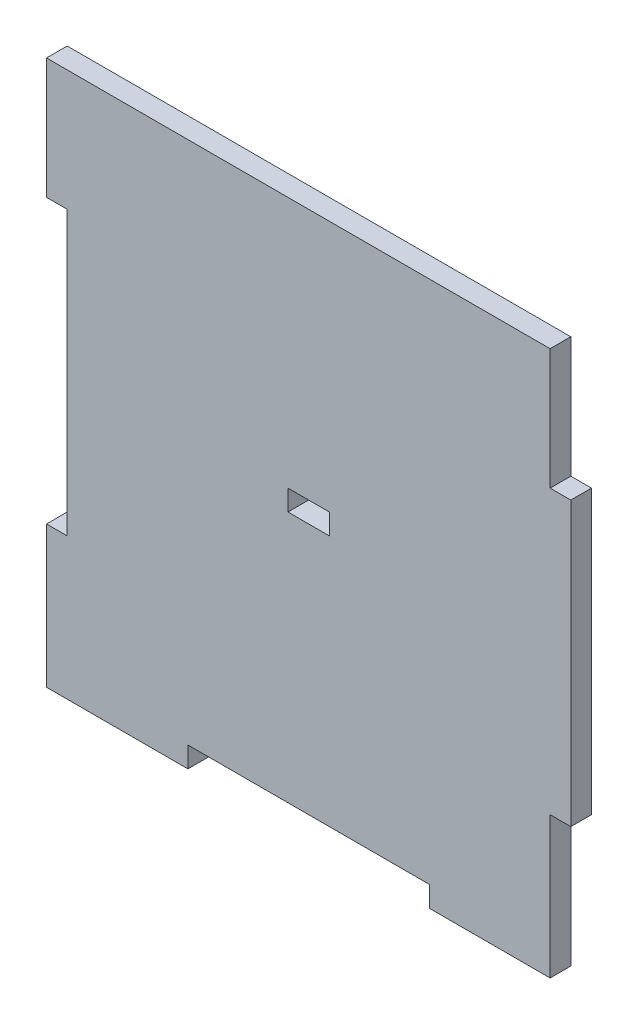
ISO-10303-21;
HEADER;
FILE_DESCRIPTION(('STEP AP214'),'2;1');
FILE_NAME('part.step','',(''),(''),'','','');
FILE_SCHEMA(('AUTOMOTIVE_DESIGN { 1 0 10303 214 1 1 1 1 }'));
ENDSEC;
DATA;
#1=APPLICATION_CONTEXT('core data for automotive mechanical design processes');
#2=APPLICATION_PROTOCOL_DEFINITION('international standard','automotive_design',2000,#1);
#3=PRODUCT_CONTEXT('',#1,'mechanical');
#4=PRODUCT('Part','Part','',(#3));
#5=PRODUCT_RELATED_PRODUCT_CATEGORY('part','',(#4));
#6=PRODUCT_DEFINITION_FORMATION('','',#4);
#7=PRODUCT_DEFINITION_CONTEXT('part definition',#1,'design');
#8=PRODUCT_DEFINITION('design','',#6,#7);
#9=PRODUCT_DEFINITION_SHAPE('','',#8);
#10=(LENGTH_UNIT() NAMED_UNIT(*) SI_UNIT(.MILLI.,.METRE.));
#11=(NAMED_UNIT(*) PLANE_ANGLE_UNIT() SI_UNIT($,.RADIAN.));
#12=(NAMED_UNIT(*) SI_UNIT($,.STERADIAN.) SOLID_ANGLE_UNIT());
#13=UNCERTAINTY_MEASURE_WITH_UNIT(LENGTH_MEASURE(1.E-05),#10,'distance_accuracy_value','');
#14=(GEOMETRIC_REPRESENTATION_CONTEXT(3) GLOBAL_UNCERTAINTY_ASSIGNED_CONTEXT((#13)) GLOBAL_UNIT_ASSIGNED_CONTEXT((#10,
#11,#12)) REPRESENTATION_CONTEXT('',''));
#15=CARTESIAN_POINT('',(0.,0.,0.));
#16=DIRECTION('',(0.,0.,1.));
#17=DIRECTION('',(1.,0.,0.));
#18=AXIS2_PLACEMENT_3D('',#15,#16,#17);
#19=CARTESIAN_POINT('',(35.,-20.5,3.));
#20=DIRECTION('',(0.,1.,0.));
#21=DIRECTION('',(-1.,0.,0.));
#22=AXIS2_PLACEMENT_3D('',#19,#20,#21);
#23=PLANE('',#22);
#24=DIRECTION('',(1.,0.,0.));
#25=VECTOR('',#24,1.);
#26=CARTESIAN_POINT('',(35.,-20.5,0.));
#27=LINE('',#26,#25);
#28=CARTESIAN_POINT('',(35.,-20.5,0.));
#29=VERTEX_POINT('',#28);
#30=CARTESIAN_POINT('',(38.,-20.5,0.));
#31=VERTEX_POINT('',#30);
#32=EDGE_CURVE('E218',#29,#31,#27,.T.);
#33=ORIENTED_EDGE('',*,*,#32,.T.);
#34=DIRECTION('',(0.,0.,-1.));
#35=VECTOR('',#34,1.);
#36=CARTESIAN_POINT('',(38.,-20.5,3.));
#37=LINE('',#36,#35);
#38=CARTESIAN_POINT('',(38.,-20.5,3.));
#39=VERTEX_POINT('',#38);
#40=EDGE_CURVE('E46',#39,#31,#37,.T.);
#41=ORIENTED_EDGE('',*,*,#40,.F.);
#42=DIRECTION('',(1.,0.,0.));
#43=VECTOR('',#42,1.);
#44=CARTESIAN_POINT('',(35.,-20.5,3.));
#45=LINE('',#44,#43);
#46=CARTESIAN_POINT('',(35.,-20.5,3.));
#47=VERTEX_POINT('',#46);
#48=EDGE_CURVE('E228',#47,#39,#45,.T.);
#49=ORIENTED_EDGE('',*,*,#48,.F.);
#50=DIRECTION('',(0.,0.,-1.));
#51=VECTOR('',#50,1.);
#52=CARTESIAN_POINT('',(35.,-20.5,3.));
#53=LINE('',#52,#51);
#54=EDGE_CURVE('E11',#47,#29,#53,.T.);
#55=ORIENTED_EDGE('',*,*,#54,.T.);
#56=EDGE_LOOP('',(#33,#41,#49,#55));
#57=FACE_BOUND('',#56,.T.);
#58=ADVANCED_FACE('F38',(#57),#23,.F.);
#59=CARTESIAN_POINT('',(38.,20.5,3.));
#60=DIRECTION('',(-1.,0.,0.));
#61=DIRECTION('',(0.,0.,1.));
#62=AXIS2_PLACEMENT_3D('',#59,#60,#61);
#63=PLANE('',#62);
#64=DIRECTION('',(0.,1.,0.));
#65=VECTOR('',#64,1.);
#66=CARTESIAN_POINT('',(38.,20.5,0.));
#67=LINE('',#66,#65);
#68=CARTESIAN_POINT('',(38.,20.5,0.));
#69=VERTEX_POINT('',#68);
#70=EDGE_CURVE('E278',#31,#69,#67,.T.);
#71=ORIENTED_EDGE('',*,*,#70,.T.);
#72=DIRECTION('',(0.,0.,-1.));
#73=VECTOR('',#72,1.);
#74=CARTESIAN_POINT('',(38.,20.5,3.));
#75=LINE('',#74,#73);
#76=CARTESIAN_POINT('',(38.,20.5,3.));
#77=VERTEX_POINT('',#76);
#78=EDGE_CURVE('E376',#77,#69,#75,.T.);
#79=ORIENTED_EDGE('',*,*,#78,.F.);
#80=DIRECTION('',(0.,1.,0.));
#81=VECTOR('',#80,1.);
#82=CARTESIAN_POINT('',(38.,20.5,3.));
#83=LINE('',#82,#81);
#84=EDGE_CURVE('E232',#39,#77,#83,.T.);
#85=ORIENTED_EDGE('',*,*,#84,.F.);
#86=ORIENTED_EDGE('',*,*,#40,.T.);
#87=EDGE_LOOP('',(#71,#79,#85,#86));
#88=FACE_BOUND('',#87,.T.);
#89=ADVANCED_FACE('F385',(#88),#63,.F.);
#90=CARTESIAN_POINT('',(35.,20.5,3.));
#91=DIRECTION('',(0.,-1.,0.));
#92=DIRECTION('',(1.,0.,0.));
#93=AXIS2_PLACEMENT_3D('',#90,#91,#92);
#94=PLANE('',#93);
#95=DIRECTION('',(-1.,0.,0.));
#96=VECTOR('',#95,1.);
#97=CARTESIAN_POINT('',(35.,20.5,0.));
#98=LINE('',#97,#96);
#99=CARTESIAN_POINT('',(35.,20.5,0.));
#100=VERTEX_POINT('',#99);
#101=EDGE_CURVE('E281',#69,#100,#98,.T.);
#102=ORIENTED_EDGE('',*,*,#101,.T.);
#103=DIRECTION('',(0.,0.,-1.));
#104=VECTOR('',#103,1.);
#105=CARTESIAN_POINT('',(35.,20.5,3.));
#106=LINE('',#105,#104);
#107=CARTESIAN_POINT('',(35.,20.5,3.));
#108=VERTEX_POINT('',#107);
#109=EDGE_CURVE('E372',#108,#100,#106,.T.);
#110=ORIENTED_EDGE('',*,*,#109,.F.);
#111=DIRECTION('',(-1.,0.,0.));
#112=VECTOR('',#111,1.);
#113=CARTESIAN_POINT('',(35.,20.5,3.));
#114=LINE('',#113,#112);
#115=EDGE_CURVE('E235',#77,#108,#114,.T.);
#116=ORIENTED_EDGE('',*,*,#115,.F.);
#117=ORIENTED_EDGE('',*,*,#78,.T.);
#118=EDGE_LOOP('',(#102,#110,#116,#117));
#119=FACE_BOUND('',#118,.T.);
#120=ADVANCED_FACE('F394',(#119),#94,.F.);
#121=CARTESIAN_POINT('',(35.,38.,3.));
#122=DIRECTION('',(-1.,0.,0.));
#123=DIRECTION('',(0.,-1.,0.));
#124=AXIS2_PLACEMENT_3D('',#121,#122,#123);
#125=PLANE('',#124);
#126=DIRECTION('',(0.,1.,0.));
#127=VECTOR('',#126,1.);
#128=CARTESIAN_POINT('',(35.,38.,0.));
#129=LINE('',#128,#127);
#130=CARTESIAN_POINT('',(35.,38.,0.));
#131=VERTEX_POINT('',#130);
#132=EDGE_CURVE('E284',#100,#131,#129,.T.);
#133=ORIENTED_EDGE('',*,*,#132,.T.);
#134=DIRECTION('',(0.,0.,-1.));
#135=VECTOR('',#134,1.);
#136=CARTESIAN_POINT('',(35.,38.,3.));
#137=LINE('',#136,#135);
#138=CARTESIAN_POINT('',(35.,38.,3.));
#139=VERTEX_POINT('',#138);
#140=EDGE_CURVE('E368',#139,#131,#137,.T.);
#141=ORIENTED_EDGE('',*,*,#140,.F.);
#142=DIRECTION('',(0.,1.,0.));
#143=VECTOR('',#142,1.);
#144=CARTESIAN_POINT('',(35.,38.,3.));
#145=LINE('',#144,#143);
#146=EDGE_CURVE('E238',#108,#139,#145,.T.);
#147=ORIENTED_EDGE('',*,*,#146,.F.);
#148=ORIENTED_EDGE('',*,*,#109,.T.);
#149=EDGE_LOOP('',(#133,#141,#147,#148));
#150=FACE_BOUND('',#149,.T.);
#151=ADVANCED_FACE('F398',(#150),#125,.F.);
#152=CARTESIAN_POINT('',(-38.,38.,3.));
#153=DIRECTION('',(0.,-1.,0.));
#154=DIRECTION('',(0.,0.,-1.));
#155=AXIS2_PLACEMENT_3D('',#152,#153,#154);
#156=PLANE('',#155);
#157=DIRECTION('',(-1.,0.,0.));
#158=VECTOR('',#157,1.);
#159=CARTESIAN_POINT('',(-38.,38.,0.));
#160=LINE('',#159,#158);
#161=CARTESIAN_POINT('',(-38.,38.,0.));
#162=VERTEX_POINT('',#161);
#163=EDGE_CURVE('E288',#131,#162,#160,.T.);
#164=ORIENTED_EDGE('',*,*,#163,.T.);
#165=DIRECTION('',(0.,0.,-1.));
#166=VECTOR('',#165,1.);
#167=CARTESIAN_POINT('',(-38.,38.,3.));
#168=LINE('',#167,#166);
#169=CARTESIAN_POINT('',(-38.,38.,3.));
#170=VERTEX_POINT('',#169);
#171=EDGE_CURVE('E364',#170,#162,#168,.T.);
#172=ORIENTED_EDGE('',*,*,#171,.F.);
#173=DIRECTION('',(-1.,0.,0.));
#174=VECTOR('',#173,1.);
#175=CARTESIAN_POINT('',(17.5,38.,3.));
#176=LINE('',#175,#174);
#177=EDGE_CURVE('E241',#139,#170,#176,.T.);
#178=ORIENTED_EDGE('',*,*,#177,.F.);
#179=ORIENTED_EDGE('',*,*,#140,.T.);
#180=EDGE_LOOP('',(#164,#172,#178,#179));
#181=FACE_BOUND('',#180,.T.);
#182=ADVANCED_FACE('F456',(#181),#156,.F.);
#183=CARTESIAN_POINT('',(-38.,20.5,3.));
#184=DIRECTION('',(1.,0.,0.));
#185=DIRECTION('',(0.,0.,-1.));
#186=AXIS2_PLACEMENT_3D('',#183,#184,#185);
#187=PLANE('',#186);
#188=DIRECTION('',(0.,-1.,0.));
#189=VECTOR('',#188,1.);
#190=CARTESIAN_POINT('',(-38.,20.5,0.));
#191=LINE('',#190,#189);
#192=CARTESIAN_POINT('',(-38.,20.5,0.));
#193=VERTEX_POINT('',#192);
#194=EDGE_CURVE('E291',#162,#193,#191,.T.);
#195=ORIENTED_EDGE('',*,*,#194,.T.);
#196=DIRECTION('',(0.,0.,-1.));
#197=VECTOR('',#196,1.);
#198=CARTESIAN_POINT('',(-38.,20.5,3.));
#199=LINE('',#198,#197);
#200=CARTESIAN_POINT('',(-38.,20.5,3.));
#201=VERTEX_POINT('',#200);
#202=EDGE_CURVE('E360',#201,#193,#199,.T.);
#203=ORIENTED_EDGE('',*,*,#202,.F.);
#204=DIRECTION('',(0.,-1.,0.));
#205=VECTOR('',#204,1.);
#206=CARTESIAN_POINT('',(-38.,20.5,3.));
#207=LINE('',#206,#205);
#208=EDGE_CURVE('E244',#170,#201,#207,.T.);
#209=ORIENTED_EDGE('',*,*,#208,.F.);
#210=ORIENTED_EDGE('',*,*,#171,.T.);
#211=EDGE_LOOP('',(#195,#203,#209,#210));
#212=FACE_BOUND('',#211,.T.);
#213=ADVANCED_FACE('F454',(#212),#187,.F.);
#214=CARTESIAN_POINT('',(-35.,20.5,3.));
#215=DIRECTION('',(0.,1.,0.));
#216=DIRECTION('',(0.,0.,1.));
#217=AXIS2_PLACEMENT_3D('',#214,#215,#216);
#218=PLANE('',#217);
#219=DIRECTION('',(1.,0.,0.));
#220=VECTOR('',#219,1.);
#221=CARTESIAN_POINT('',(-35.,20.5,0.));
#222=LINE('',#221,#220);
#223=CARTESIAN_POINT('',(-35.,20.5,0.));
#224=VERTEX_POINT('',#223);
#225=EDGE_CURVE('E294',#193,#224,#222,.T.);
#226=ORIENTED_EDGE('',*,*,#225,.T.);
#227=DIRECTION('',(0.,0.,-1.));
#228=VECTOR('',#227,1.);
#229=CARTESIAN_POINT('',(-35.,20.5,3.));
#230=LINE('',#229,#228);
#231=CARTESIAN_POINT('',(-35.,20.5,3.));
#232=VERTEX_POINT('',#231);
#233=EDGE_CURVE('E356',#232,#224,#230,.T.);
#234=ORIENTED_EDGE('',*,*,#233,.F.);
#235=DIRECTION('',(1.,0.,0.));
#236=VECTOR('',#235,1.);
#237=CARTESIAN_POINT('',(-35.,20.5,3.));
#238=LINE('',#237,#236);
#239=EDGE_CURVE('E247',#201,#232,#238,.T.);
#240=ORIENTED_EDGE('',*,*,#239,.F.);
#241=ORIENTED_EDGE('',*,*,#202,.T.);
#242=EDGE_LOOP('',(#226,#234,#240,#241));
#243=FACE_BOUND('',#242,.T.);
#244=ADVANCED_FACE('F449',(#243),#218,.F.);
#245=CARTESIAN_POINT('',(-35.,20.5,3.));
#246=DIRECTION('',(1.,0.,0.));
#247=DIRECTION('',(0.,0.,-1.));
#248=AXIS2_PLACEMENT_3D('',#245,#246,#247);
#249=PLANE('',#248);
#250=DIRECTION('',(0.,-1.,0.));
#251=VECTOR('',#250,1.);
#252=CARTESIAN_POINT('',(-35.,20.5,0.));
#253=LINE('',#252,#251);
#254=CARTESIAN_POINT('',(-35.,-20.5,0.));
#255=VERTEX_POINT('',#254);
#256=EDGE_CURVE('E297',#224,#255,#253,.T.);
#257=ORIENTED_EDGE('',*,*,#256,.T.);
#258=DIRECTION('',(0.,0.,-1.));
#259=VECTOR('',#258,1.);
#260=CARTESIAN_POINT('',(-35.,-20.5,3.));
#261=LINE('',#260,#259);
#262=CARTESIAN_POINT('',(-35.,-20.5,3.));
#263=VERTEX_POINT('',#262);
#264=EDGE_CURVE('E352',#263,#255,#261,.T.);
#265=ORIENTED_EDGE('',*,*,#264,.F.);
#266=DIRECTION('',(0.,-1.,0.));
#267=VECTOR('',#266,1.);
#268=CARTESIAN_POINT('',(-35.,20.5,3.));
#269=LINE('',#268,#267);
#270=EDGE_CURVE('E250',#232,#263,#269,.T.);
#271=ORIENTED_EDGE('',*,*,#270,.F.);
#272=ORIENTED_EDGE('',*,*,#233,.T.);
#273=EDGE_LOOP('',(#257,#265,#271,#272));
#274=FACE_BOUND('',#273,.T.);
#275=ADVANCED_FACE('F444',(#274),#249,.F.);
#276=CARTESIAN_POINT('',(-35.,-20.5,3.));
#277=DIRECTION('',(0.,-1.,0.));
#278=DIRECTION('',(0.,0.,-1.));
#279=AXIS2_PLACEMENT_3D('',#276,#277,#278);
#280=PLANE('',#279);
#281=DIRECTION('',(-1.,0.,0.));
#282=VECTOR('',#281,1.);
#283=CARTESIAN_POINT('',(-35.,-20.5,0.));
#284=LINE('',#283,#282);
#285=CARTESIAN_POINT('',(-38.,-20.5,0.));
#286=VERTEX_POINT('',#285);
#287=EDGE_CURVE('E300',#255,#286,#284,.T.);
#288=ORIENTED_EDGE('',*,*,#287,.T.);
#289=DIRECTION('',(0.,0.,-1.));
#290=VECTOR('',#289,1.);
#291=CARTESIAN_POINT('',(-38.,-20.5,3.));
#292=LINE('',#291,#290);
#293=CARTESIAN_POINT('',(-38.,-20.5,3.));
#294=VERTEX_POINT('',#293);
#295=EDGE_CURVE('E348',#294,#286,#292,.T.);
#296=ORIENTED_EDGE('',*,*,#295,.F.);
#297=DIRECTION('',(-1.,0.,0.));
#298=VECTOR('',#297,1.);
#299=CARTESIAN_POINT('',(-35.,-20.5,3.));
#300=LINE('',#299,#298);
#301=EDGE_CURVE('E253',#263,#294,#300,.T.);
#302=ORIENTED_EDGE('',*,*,#301,.F.);
#303=ORIENTED_EDGE('',*,*,#264,.T.);
#304=EDGE_LOOP('',(#288,#296,#302,#303));
#305=FACE_BOUND('',#304,.T.);
#306=ADVANCED_FACE('F439',(#305),#280,.F.);
#307=CARTESIAN_POINT('',(-38.,-38.,3.));
#308=DIRECTION('',(1.,0.,0.));
#309=DIRECTION('',(0.,0.,-1.));
#310=AXIS2_PLACEMENT_3D('',#307,#308,#309);
#311=PLANE('',#310);
#312=DIRECTION('',(0.,-1.,0.));
#313=VECTOR('',#312,1.);
#314=CARTESIAN_POINT('',(-38.,-38.,0.));
#315=LINE('',#314,#313);
#316=CARTESIAN_POINT('',(-38.,-41.,0.));
#317=VERTEX_POINT('',#316);
#318=EDGE_CURVE('E304',#286,#317,#315,.T.);
#319=ORIENTED_EDGE('',*,*,#318,.T.);
#320=DIRECTION('',(0.,0.,-1.));
#321=VECTOR('',#320,1.);
#322=CARTESIAN_POINT('',(-38.,-41.,3.));
#323=LINE('',#322,#321);
#324=CARTESIAN_POINT('',(-38.,-41.,3.));
#325=VERTEX_POINT('',#324);
#326=EDGE_CURVE('E344',#325,#317,#323,.T.);
#327=ORIENTED_EDGE('',*,*,#326,.F.);
#328=DIRECTION('',(0.,-1.,0.));
#329=VECTOR('',#328,1.);
#330=CARTESIAN_POINT('',(-38.,-20.5,3.));
#331=LINE('',#330,#329);
#332=EDGE_CURVE('E256',#294,#325,#331,.T.);
#333=ORIENTED_EDGE('',*,*,#332,.F.);
#334=ORIENTED_EDGE('',*,*,#295,.T.);
#335=EDGE_LOOP('',(#319,#327,#333,#334));
#336=FACE_BOUND('',#335,.T.);
#337=ADVANCED_FACE('F434',(#336),#311,.F.);
#338=CARTESIAN_POINT('',(-35.,-41.,3.));
#339=DIRECTION('',(0.,1.,0.));
#340=DIRECTION('',(0.,0.,1.));
#341=AXIS2_PLACEMENT_3D('',#338,#339,#340);
#342=PLANE('',#341);
#343=DIRECTION('',(1.,0.,0.));
#344=VECTOR('',#343,1.);
#345=CARTESIAN_POINT('',(-35.,-41.,0.));
#346=LINE('',#345,#344);
#347=CARTESIAN_POINT('',(-17.5,-41.,0.));
#348=VERTEX_POINT('',#347);
#349=EDGE_CURVE('E308',#317,#348,#346,.T.);
#350=ORIENTED_EDGE('',*,*,#349,.T.);
#351=DIRECTION('',(0.,0.,-1.));
#352=VECTOR('',#351,1.);
#353=CARTESIAN_POINT('',(-17.5,-41.,3.));
#354=LINE('',#353,#352);
#355=CARTESIAN_POINT('',(-17.5,-41.,3.));
#356=VERTEX_POINT('',#355);
#357=EDGE_CURVE('E340',#356,#348,#354,.T.);
#358=ORIENTED_EDGE('',*,*,#357,.F.);
#359=DIRECTION('',(1.,0.,0.));
#360=VECTOR('',#359,1.);
#361=CARTESIAN_POINT('',(-38.,-41.,3.));
#362=LINE('',#361,#360);
#363=EDGE_CURVE('E259',#325,#356,#362,.T.);
#364=ORIENTED_EDGE('',*,*,#363,.F.);
#365=ORIENTED_EDGE('',*,*,#326,.T.);
#366=EDGE_LOOP('',(#350,#358,#364,#365));
#367=FACE_BOUND('',#366,.T.);
#368=ADVANCED_FACE('F430',(#367),#342,.F.);
#369=CARTESIAN_POINT('',(-17.5,-38.,3.));
#370=DIRECTION('',(-1.,0.,0.));
#371=DIRECTION('',(0.,0.,1.));
#372=AXIS2_PLACEMENT_3D('',#369,#370,#371);
#373=PLANE('',#372);
#374=DIRECTION('',(0.,1.,0.));
#375=VECTOR('',#374,1.);
#376=CARTESIAN_POINT('',(-17.5,-38.,0.));
#377=LINE('',#376,#375);
#378=CARTESIAN_POINT('',(-17.5,-38.,0.));
#379=VERTEX_POINT('',#378);
#380=EDGE_CURVE('E311',#348,#379,#377,.T.);
#381=ORIENTED_EDGE('',*,*,#380,.T.);
#382=DIRECTION('',(0.,0.,-1.));
#383=VECTOR('',#382,1.);
#384=CARTESIAN_POINT('',(-17.5,-38.,3.));
#385=LINE('',#384,#383);
#386=CARTESIAN_POINT('',(-17.5,-38.,3.));
#387=VERTEX_POINT('',#386);
#388=EDGE_CURVE('E336',#387,#379,#385,.T.);
#389=ORIENTED_EDGE('',*,*,#388,.F.);
#390=DIRECTION('',(0.,1.,0.));
#391=VECTOR('',#390,1.);
#392=CARTESIAN_POINT('',(-17.5,-38.,3.));
#393=LINE('',#392,#391);
#394=EDGE_CURVE('E262',#356,#387,#393,.T.);
#395=ORIENTED_EDGE('',*,*,#394,.F.);
#396=ORIENTED_EDGE('',*,*,#357,.T.);
#397=EDGE_LOOP('',(#381,#389,#395,#396));
#398=FACE_BOUND('',#397,.T.);
#399=ADVANCED_FACE('F425',(#398),#373,.F.);
#400=CARTESIAN_POINT('',(-17.5,-38.,3.));
#401=DIRECTION('',(0.,1.,0.));
#402=DIRECTION('',(-1.,0.,0.));
#403=AXIS2_PLACEMENT_3D('',#400,#401,#402);
#404=PLANE('',#403);
#405=DIRECTION('',(1.,0.,0.));
#406=VECTOR('',#405,1.);
#407=CARTESIAN_POINT('',(-17.5,-38.,0.));
#408=LINE('',#407,#406);
#409=CARTESIAN_POINT('',(17.5,-38.,0.));
#410=VERTEX_POINT('',#409);
#411=EDGE_CURVE('E314',#379,#410,#408,.T.);
#412=ORIENTED_EDGE('',*,*,#411,.T.);
#413=DIRECTION('',(0.,0.,-1.));
#414=VECTOR('',#413,1.);
#415=CARTESIAN_POINT('',(17.5,-38.,3.));
#416=LINE('',#415,#414);
#417=CARTESIAN_POINT('',(17.5,-38.,3.));
#418=VERTEX_POINT('',#417);
#419=EDGE_CURVE('E332',#418,#410,#416,.T.);
#420=ORIENTED_EDGE('',*,*,#419,.F.);
#421=DIRECTION('',(1.,0.,0.));
#422=VECTOR('',#421,1.);
#423=CARTESIAN_POINT('',(-17.5,-38.,3.));
#424=LINE('',#423,#422);
#425=EDGE_CURVE('E265',#387,#418,#424,.T.);
#426=ORIENTED_EDGE('',*,*,#425,.F.);
#427=ORIENTED_EDGE('',*,*,#388,.T.);
#428=EDGE_LOOP('',(#412,#420,#426,#427));
#429=FACE_BOUND('',#428,.T.);
#430=ADVANCED_FACE('F421',(#429),#404,.F.);
#431=CARTESIAN_POINT('',(17.5,-41.,3.));
#432=DIRECTION('',(1.,0.,0.));
#433=DIRECTION('',(0.,1.,0.));
#434=AXIS2_PLACEMENT_3D('',#431,#432,#433);
#435=PLANE('',#434);
#436=DIRECTION('',(0.,-1.,0.));
#437=VECTOR('',#436,1.);
#438=CARTESIAN_POINT('',(17.5,-41.,0.));
#439=LINE('',#438,#437);
#440=CARTESIAN_POINT('',(17.5,-41.,0.));
#441=VERTEX_POINT('',#440);
#442=EDGE_CURVE('E317',#410,#441,#439,.T.);
#443=ORIENTED_EDGE('',*,*,#442,.T.);
#444=DIRECTION('',(0.,0.,-1.));
#445=VECTOR('',#444,1.);
#446=CARTESIAN_POINT('',(17.5,-41.,3.));
#447=LINE('',#446,#445);
#448=CARTESIAN_POINT('',(17.5,-41.,3.));
#449=VERTEX_POINT('',#448);
#450=EDGE_CURVE('E328',#449,#441,#447,.T.);
#451=ORIENTED_EDGE('',*,*,#450,.F.);
#452=DIRECTION('',(0.,-1.,0.));
#453=VECTOR('',#452,1.);
#454=CARTESIAN_POINT('',(17.5,-41.,3.));
#455=LINE('',#454,#453);
#456=EDGE_CURVE('E268',#418,#449,#455,.T.);
#457=ORIENTED_EDGE('',*,*,#456,.F.);
#458=ORIENTED_EDGE('',*,*,#419,.T.);
#459=EDGE_LOOP('',(#443,#451,#457,#458));
#460=FACE_BOUND('',#459,.T.);
#461=ADVANCED_FACE('F417',(#460),#435,.F.);
#462=CARTESIAN_POINT('',(35.,-41.,3.));
#463=DIRECTION('',(0.,1.,0.));
#464=DIRECTION('',(-1.,0.,0.));
#465=AXIS2_PLACEMENT_3D('',#462,#463,#464);
#466=PLANE('',#465);
#467=DIRECTION('',(1.,0.,0.));
#468=VECTOR('',#467,1.);
#469=CARTESIAN_POINT('',(35.,-41.,0.));
#470=LINE('',#469,#468);
#471=CARTESIAN_POINT('',(35.,-41.,0.));
#472=VERTEX_POINT('',#471);
#473=EDGE_CURVE('E320',#441,#472,#470,.T.);
#474=ORIENTED_EDGE('',*,*,#473,.T.);
#475=DIRECTION('',(0.,0.,-1.));
#476=VECTOR('',#475,1.);
#477=CARTESIAN_POINT('',(35.,-41.,3.));
#478=LINE('',#477,#476);
#479=CARTESIAN_POINT('',(35.,-41.,3.));
#480=VERTEX_POINT('',#479);
#481=EDGE_CURVE('E275',#480,#472,#478,.T.);
#482=ORIENTED_EDGE('',*,*,#481,.F.);
#483=DIRECTION('',(1.,0.,0.));
#484=VECTOR('',#483,1.);
#485=CARTESIAN_POINT('',(35.,-41.,3.));
#486=LINE('',#485,#484);
#487=EDGE_CURVE('E271',#449,#480,#486,.T.);
#488=ORIENTED_EDGE('',*,*,#487,.F.);
#489=ORIENTED_EDGE('',*,*,#450,.T.);
#490=EDGE_LOOP('',(#474,#482,#488,#489));
#491=FACE_BOUND('',#490,.T.);
#492=ADVANCED_FACE('F412',(#491),#466,.F.);
#493=CARTESIAN_POINT('',(35.,-38.,3.));
#494=DIRECTION('',(-1.,0.,0.));
#495=DIRECTION('',(0.,-1.,0.));
#496=AXIS2_PLACEMENT_3D('',#493,#494,#495);
#497=PLANE('',#496);
#498=DIRECTION('',(0.,1.,0.));
#499=VECTOR('',#498,1.);
#500=CARTESIAN_POINT('',(35.,-38.,0.));
#501=LINE('',#500,#499);
#502=EDGE_CURVE('E229',#472,#29,#501,.T.);
#503=ORIENTED_EDGE('',*,*,#502,.T.);
#504=ORIENTED_EDGE('',*,*,#54,.F.);
#505=DIRECTION('',(0.,1.,0.));
#506=VECTOR('',#505,1.);
#507=CARTESIAN_POINT('',(35.,-20.5,3.));
#508=LINE('',#507,#506);
#509=EDGE_CURVE('E224',#480,#47,#508,.T.);
#510=ORIENTED_EDGE('',*,*,#509,.F.);
#511=ORIENTED_EDGE('',*,*,#481,.T.);
#512=EDGE_LOOP('',(#503,#504,#510,#511));
#513=FACE_BOUND('',#512,.T.);
#514=ADVANCED_FACE('F406',(#513),#497,.F.);
#515=CARTESIAN_POINT('',(0.,0.,3.));
#516=DIRECTION('',(0.,0.,-1.));
#517=DIRECTION('',(-1.,0.,0.));
#518=AXIS2_PLACEMENT_3D('',#515,#516,#517);
#519=PLANE('',#518);
#520=DIRECTION('',(-1.,0.,0.));
#521=VECTOR('',#520,1.);
#522=CARTESIAN_POINT('',(-3.,1.5,3.));
#523=LINE('',#522,#521);
#524=CARTESIAN_POINT('',(3.,1.5,3.));
#525=VERTEX_POINT('',#524);
#526=CARTESIAN_POINT('',(-3.,1.5,3.));
#527=VERTEX_POINT('',#526);
#528=EDGE_CURVE('E209',#525,#527,#523,.T.);
#529=ORIENTED_EDGE('',*,*,#528,.F.);
#530=DIRECTION('',(0.,1.,0.));
#531=VECTOR('',#530,1.);
#532=CARTESIAN_POINT('',(3.,-1.5,3.));
#533=LINE('',#532,#531);
#534=CARTESIAN_POINT('',(3.,-1.5,3.));
#535=VERTEX_POINT('',#534);
#536=EDGE_CURVE('E53',#535,#525,#533,.T.);
#537=ORIENTED_EDGE('',*,*,#536,.F.);
#538=DIRECTION('',(1.,0.,0.));
#539=VECTOR('',#538,1.);
#540=CARTESIAN_POINT('',(-3.,-1.5,3.));
#541=LINE('',#540,#539);
#542=CARTESIAN_POINT('',(-3.,-1.5,3.));
#543=VERTEX_POINT('',#542);
#544=EDGE_CURVE('E196',#543,#535,#541,.T.);
#545=ORIENTED_EDGE('',*,*,#544,.F.);
#546=DIRECTION('',(0.,-1.,0.));
#547=VECTOR('',#546,1.);
#548=CARTESIAN_POINT('',(-3.,-1.5,3.));
#549=LINE('',#548,#547);
#550=EDGE_CURVE('E200',#527,#543,#549,.T.);
#551=ORIENTED_EDGE('',*,*,#550,.F.);
#552=EDGE_LOOP('',(#529,#537,#545,#551));
#553=FACE_BOUND('',#552,.T.);
#554=ORIENTED_EDGE('',*,*,#509,.T.);
#555=ORIENTED_EDGE('',*,*,#48,.T.);
#556=ORIENTED_EDGE('',*,*,#84,.T.);
#557=ORIENTED_EDGE('',*,*,#115,.T.);
#558=ORIENTED_EDGE('',*,*,#146,.T.);
#559=ORIENTED_EDGE('',*,*,#177,.T.);
#560=ORIENTED_EDGE('',*,*,#208,.T.);
#561=ORIENTED_EDGE('',*,*,#239,.T.);
#562=ORIENTED_EDGE('',*,*,#270,.T.);
#563=ORIENTED_EDGE('',*,*,#301,.T.);
#564=ORIENTED_EDGE('',*,*,#332,.T.);
#565=ORIENTED_EDGE('',*,*,#363,.T.);
#566=ORIENTED_EDGE('',*,*,#394,.T.);
#567=ORIENTED_EDGE('',*,*,#425,.T.);
#568=ORIENTED_EDGE('',*,*,#456,.T.);
#569=ORIENTED_EDGE('',*,*,#487,.T.);
#570=EDGE_LOOP('',(#554,#555,#556,#557,#558,#559,#560,#561,#562,#563,#564,#565,#566,#567,#568,#569));
#571=FACE_BOUND('',#570,.T.);
#572=ADVANCED_FACE('F402',(#553,#571),#519,.F.);
#573=CARTESIAN_POINT('',(0.,0.,0.));
#574=DIRECTION('',(0.,0.,-1.));
#575=DIRECTION('',(-1.,0.,0.));
#576=AXIS2_PLACEMENT_3D('',#573,#574,#575);
#577=PLANE('',#576);
#578=DIRECTION('',(0.,1.,0.));
#579=VECTOR('',#578,1.);
#580=CARTESIAN_POINT('',(3.,-1.5,0.));
#581=LINE('',#580,#579);
#582=CARTESIAN_POINT('',(3.,-1.5,0.));
#583=VERTEX_POINT('',#582);
#584=CARTESIAN_POINT('',(3.,1.5,0.));
#585=VERTEX_POINT('',#584);
#586=EDGE_CURVE('E177',#583,#585,#581,.T.);
#587=ORIENTED_EDGE('',*,*,#586,.T.);
#588=DIRECTION('',(-1.,0.,0.));
#589=VECTOR('',#588,1.);
#590=CARTESIAN_POINT('',(-3.,1.5,0.));
#591=LINE('',#590,#589);
#592=CARTESIAN_POINT('',(-3.,1.5,0.));
#593=VERTEX_POINT('',#592);
#594=EDGE_CURVE('E187',#585,#593,#591,.T.);
#595=ORIENTED_EDGE('',*,*,#594,.T.);
#596=DIRECTION('',(0.,-1.,0.));
#597=VECTOR('',#596,1.);
#598=CARTESIAN_POINT('',(-3.,-1.5,0.));
#599=LINE('',#598,#597);
#600=CARTESIAN_POINT('',(-3.,-1.5,0.));
#601=VERTEX_POINT('',#600);
#602=EDGE_CURVE('E61',#593,#601,#599,.T.);
#603=ORIENTED_EDGE('',*,*,#602,.T.);
#604=DIRECTION('',(1.,0.,0.));
#605=VECTOR('',#604,1.);
#606=CARTESIAN_POINT('',(-3.,-1.5,0.));
#607=LINE('',#606,#605);
#608=EDGE_CURVE('E184',#601,#583,#607,.T.);
#609=ORIENTED_EDGE('',*,*,#608,.T.);
#610=EDGE_LOOP('',(#587,#595,#603,#609));
#611=FACE_BOUND('',#610,.T.);
#612=ORIENTED_EDGE('',*,*,#32,.F.);
#613=ORIENTED_EDGE('',*,*,#502,.F.);
#614=ORIENTED_EDGE('',*,*,#473,.F.);
#615=ORIENTED_EDGE('',*,*,#442,.F.);
#616=ORIENTED_EDGE('',*,*,#411,.F.);
#617=ORIENTED_EDGE('',*,*,#380,.F.);
#618=ORIENTED_EDGE('',*,*,#349,.F.);
#619=ORIENTED_EDGE('',*,*,#318,.F.);
#620=ORIENTED_EDGE('',*,*,#287,.F.);
#621=ORIENTED_EDGE('',*,*,#256,.F.);
#622=ORIENTED_EDGE('',*,*,#225,.F.);
#623=ORIENTED_EDGE('',*,*,#194,.F.);
#624=ORIENTED_EDGE('',*,*,#163,.F.);
#625=ORIENTED_EDGE('',*,*,#132,.F.);
#626=ORIENTED_EDGE('',*,*,#101,.F.);
#627=ORIENTED_EDGE('',*,*,#70,.F.);
#628=EDGE_LOOP('',(#612,#613,#614,#615,#616,#617,#618,#619,#620,#621,#622,#623,#624,#625,#626,#627));
#629=FACE_BOUND('',#628,.T.);
#630=ADVANCED_FACE('F192',(#611,#629),#577,.T.);
#631=CARTESIAN_POINT('',(3.,-1.5,0.));
#632=DIRECTION('',(1.,0.,0.));
#633=DIRECTION('',(0.,0.,-1.));
#634=AXIS2_PLACEMENT_3D('',#631,#632,#633);
#635=PLANE('',#634);
#636=ORIENTED_EDGE('',*,*,#536,.T.);
#637=DIRECTION('',(0.,0.,1.));
#638=VECTOR('',#637,1.);
#639=CARTESIAN_POINT('',(3.,1.5,0.));
#640=LINE('',#639,#638);
#641=EDGE_CURVE('E173',#585,#525,#640,.T.);
#642=ORIENTED_EDGE('',*,*,#641,.F.);
#643=ORIENTED_EDGE('',*,*,#586,.F.);
#644=DIRECTION('',(0.,0.,1.));
#645=VECTOR('',#644,1.);
#646=CARTESIAN_POINT('',(3.,-1.5,0.));
#647=LINE('',#646,#645);
#648=EDGE_CURVE('E215',#583,#535,#647,.T.);
#649=ORIENTED_EDGE('',*,*,#648,.T.);
#650=EDGE_LOOP('',(#636,#642,#643,#649));
#651=FACE_BOUND('',#650,.T.);
#652=ADVANCED_FACE('F175',(#651),#635,.F.);
#653=CARTESIAN_POINT('',(-3.,-1.5,0.));
#654=DIRECTION('',(0.,-1.,0.));
#655=DIRECTION('',(0.,0.,-1.));
#656=AXIS2_PLACEMENT_3D('',#653,#654,#655);
#657=PLANE('',#656);
#658=ORIENTED_EDGE('',*,*,#544,.T.);
#659=ORIENTED_EDGE('',*,*,#648,.F.);
#660=ORIENTED_EDGE('',*,*,#608,.F.);
#661=DIRECTION('',(0.,0.,1.));
#662=VECTOR('',#661,1.);
#663=CARTESIAN_POINT('',(-3.,-1.5,0.));
#664=LINE('',#663,#662);
#665=EDGE_CURVE('E219',#601,#543,#664,.T.);
#666=ORIENTED_EDGE('',*,*,#665,.T.);
#667=EDGE_LOOP('',(#658,#659,#660,#666));
#668=FACE_BOUND('',#667,.T.);
#669=ADVANCED_FACE('F596',(#668),#657,.F.);
#670=CARTESIAN_POINT('',(-3.,-1.5,0.));
#671=DIRECTION('',(-1.,0.,0.));
#672=DIRECTION('',(0.,0.,1.));
#673=AXIS2_PLACEMENT_3D('',#670,#671,#672);
#674=PLANE('',#673);
#675=ORIENTED_EDGE('',*,*,#550,.T.);
#676=ORIENTED_EDGE('',*,*,#665,.F.);
#677=ORIENTED_EDGE('',*,*,#602,.F.);
#678=DIRECTION('',(0.,0.,1.));
#679=VECTOR('',#678,1.);
#680=CARTESIAN_POINT('',(-3.,1.5,0.));
#681=LINE('',#680,#679);
#682=EDGE_CURVE('E183',#593,#527,#681,.T.);
#683=ORIENTED_EDGE('',*,*,#682,.T.);
#684=EDGE_LOOP('',(#675,#676,#677,#683));
#685=FACE_BOUND('',#684,.T.);
#686=ADVANCED_FACE('F605',(#685),#674,.F.);
#687=CARTESIAN_POINT('',(-3.,1.5,0.));
#688=DIRECTION('',(0.,1.,0.));
#689=DIRECTION('',(0.,0.,1.));
#690=AXIS2_PLACEMENT_3D('',#687,#688,#689);
#691=PLANE('',#690);
#692=ORIENTED_EDGE('',*,*,#528,.T.);
#693=ORIENTED_EDGE('',*,*,#682,.F.);
#694=ORIENTED_EDGE('',*,*,#594,.F.);
#695=ORIENTED_EDGE('',*,*,#641,.T.);
#696=EDGE_LOOP('',(#692,#693,#694,#695));
#697=FACE_BOUND('',#696,.T.);
#698=ADVANCED_FACE('F188',(#697),#691,.F.);
#699=CLOSED_SHELL('',(#58,#89,#120,#151,#182,#213,#244,#275,#306,#337,#368,#399,#430,#461,#492,
#514,#572,#630,#652,#669,#686,#698));
#700=MANIFOLD_SOLID_BREP('B2',#699);
#701=ADVANCED_BREP_SHAPE_REPRESENTATION('',(#18,#700),#14);
#702=SHAPE_DEFINITION_REPRESENTATION(#9,#701);
ENDSEC;
END-ISO-10303-21;
